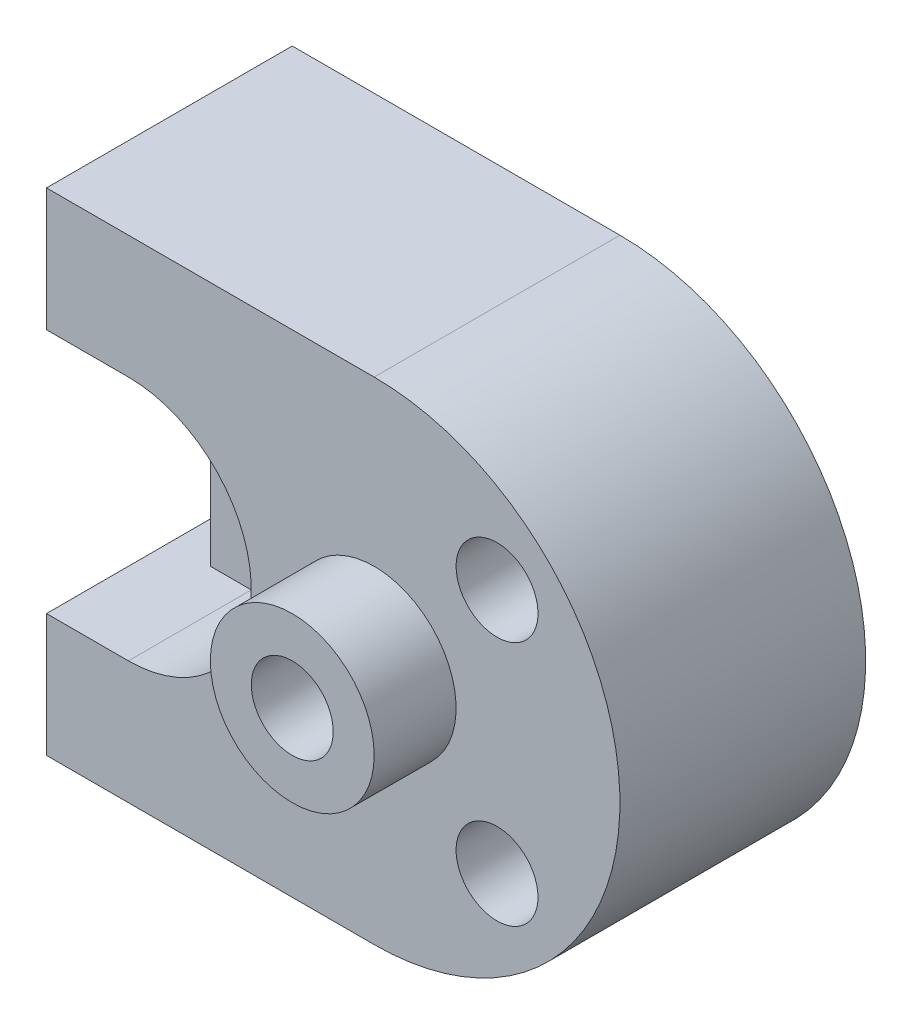
ISO-10303-21;
HEADER;
FILE_DESCRIPTION(('STEP AP214'),'2;1');
FILE_NAME('part.step','',(''),(''),'','','');
FILE_SCHEMA(('AUTOMOTIVE_DESIGN { 1 0 10303 214 1 1 1 1 }'));
ENDSEC;
DATA;
#1=APPLICATION_CONTEXT('core data for automotive mechanical design processes');
#2=APPLICATION_PROTOCOL_DEFINITION('international standard','automotive_design',2000,#1);
#3=PRODUCT_CONTEXT('',#1,'mechanical');
#4=PRODUCT('Part','Part','',(#3));
#5=PRODUCT_RELATED_PRODUCT_CATEGORY('part','',(#4));
#6=PRODUCT_DEFINITION_FORMATION('','',#4);
#7=PRODUCT_DEFINITION_CONTEXT('part definition',#1,'design');
#8=PRODUCT_DEFINITION('design','',#6,#7);
#9=PRODUCT_DEFINITION_SHAPE('','',#8);
#10=(LENGTH_UNIT() NAMED_UNIT(*) SI_UNIT(.MILLI.,.METRE.));
#11=(NAMED_UNIT(*) PLANE_ANGLE_UNIT() SI_UNIT($,.RADIAN.));
#12=(NAMED_UNIT(*) SI_UNIT($,.STERADIAN.) SOLID_ANGLE_UNIT());
#13=UNCERTAINTY_MEASURE_WITH_UNIT(LENGTH_MEASURE(1.E-05),#10,'distance_accuracy_value','');
#14=(GEOMETRIC_REPRESENTATION_CONTEXT(3) GLOBAL_UNCERTAINTY_ASSIGNED_CONTEXT((#13)) GLOBAL_UNIT_ASSIGNED_CONTEXT((#10,
#11,#12)) REPRESENTATION_CONTEXT('',''));
#15=CARTESIAN_POINT('',(0.,0.,0.));
#16=DIRECTION('',(0.,0.,1.));
#17=DIRECTION('',(1.,0.,0.));
#18=AXIS2_PLACEMENT_3D('',#15,#16,#17);
#19=CARTESIAN_POINT('',(0.,0.,60.));
#20=DIRECTION('',(0.,0.,-1.));
#21=DIRECTION('',(-1.,0.,0.));
#22=AXIS2_PLACEMENT_3D('',#19,#20,#21);
#23=PLANE('',#22);
#24=CARTESIAN_POINT('',(110.,90.,60.));
#25=DIRECTION('',(0.,0.,-1.));
#26=DIRECTION('',(-1.,0.,0.));
#27=AXIS2_PLACEMENT_3D('',#24,#25,#26);
#28=CIRCLE('',#27,9.99999999999999);
#29=CARTESIAN_POINT('',(100.,90.,60.));
#30=VERTEX_POINT('',#29);
#31=EDGE_CURVE('E153',#30,#30,#28,.F.);
#32=ORIENTED_EDGE('',*,*,#31,.F.);
#33=EDGE_LOOP('',(#32));
#34=FACE_BOUND('',#33,.T.);
#35=DIRECTION('',(1.,0.,0.));
#36=VECTOR('',#35,1.);
#37=CARTESIAN_POINT('',(0.,90.,60.));
#38=LINE('',#37,#36);
#39=CARTESIAN_POINT('',(0.,90.,60.));
#40=VERTEX_POINT('',#39);
#41=CARTESIAN_POINT('',(20.,90.,60.));
#42=VERTEX_POINT('',#41);
#43=EDGE_CURVE('E189',#40,#42,#38,.T.);
#44=ORIENTED_EDGE('',*,*,#43,.T.);
#45=CARTESIAN_POINT('',(20.,60.,60.));
#46=DIRECTION('',(0.,0.,-1.));
#47=DIRECTION('',(-1.,0.,0.));
#48=AXIS2_PLACEMENT_3D('',#45,#46,#47);
#49=CIRCLE('',#48,30.);
#50=CARTESIAN_POINT('',(20.,30.,60.));
#51=VERTEX_POINT('',#50);
#52=EDGE_CURVE('E41',#42,#51,#49,.T.);
#53=ORIENTED_EDGE('',*,*,#52,.T.);
#54=DIRECTION('',(1.,0.,0.));
#55=VECTOR('',#54,1.);
#56=CARTESIAN_POINT('',(0.,30.,60.));
#57=LINE('',#56,#55);
#58=CARTESIAN_POINT('',(0.,30.,60.));
#59=VERTEX_POINT('',#58);
#60=EDGE_CURVE('E187',#59,#51,#57,.T.);
#61=ORIENTED_EDGE('',*,*,#60,.F.);
#62=DIRECTION('',(0.,-1.,0.));
#63=VECTOR('',#62,1.);
#64=CARTESIAN_POINT('',(0.,0.,60.));
#65=LINE('',#64,#63);
#66=CARTESIAN_POINT('',(0.,0.,60.));
#67=VERTEX_POINT('',#66);
#68=EDGE_CURVE('E213',#59,#67,#65,.T.);
#69=ORIENTED_EDGE('',*,*,#68,.T.);
#70=DIRECTION('',(1.,0.,0.));
#71=VECTOR('',#70,1.);
#72=CARTESIAN_POINT('',(0.,0.,60.));
#73=LINE('',#72,#71);
#74=CARTESIAN_POINT('',(80.,0.,60.));
#75=VERTEX_POINT('',#74);
#76=EDGE_CURVE('E212',#67,#75,#73,.T.);
#77=ORIENTED_EDGE('',*,*,#76,.T.);
#78=CARTESIAN_POINT('',(80.,60.,60.));
#79=DIRECTION('',(0.,0.,1.));
#80=DIRECTION('',(1.,0.,0.));
#81=AXIS2_PLACEMENT_3D('',#78,#79,#80);
#82=CIRCLE('',#81,60.);
#83=CARTESIAN_POINT('',(80.,120.,60.));
#84=VERTEX_POINT('',#83);
#85=EDGE_CURVE('E200',#84,#75,#82,.F.);
#86=ORIENTED_EDGE('',*,*,#85,.F.);
#87=DIRECTION('',(-1.,0.,0.));
#88=VECTOR('',#87,1.);
#89=CARTESIAN_POINT('',(0.,120.,60.));
#90=LINE('',#89,#88);
#91=CARTESIAN_POINT('',(0.,120.,60.));
#92=VERTEX_POINT('',#91);
#93=EDGE_CURVE('E216',#84,#92,#90,.T.);
#94=ORIENTED_EDGE('',*,*,#93,.T.);
#95=EDGE_CURVE('E209',#92,#40,#65,.T.);
#96=ORIENTED_EDGE('',*,*,#95,.T.);
#97=EDGE_LOOP('',(#44,#53,#61,#69,#77,#86,#94,#96));
#98=FACE_BOUND('',#97,.T.);
#99=CARTESIAN_POINT('',(110.,30.,60.));
#100=DIRECTION('',(0.,0.,1.));
#101=DIRECTION('',(1.,0.,0.));
#102=AXIS2_PLACEMENT_3D('',#99,#100,#101);
#103=CIRCLE('',#102,9.99999999999999);
#104=CARTESIAN_POINT('',(120.,30.,60.));
#105=VERTEX_POINT('',#104);
#106=EDGE_CURVE('E138',#105,#105,#103,.T.);
#107=ORIENTED_EDGE('',*,*,#106,.F.);
#108=EDGE_LOOP('',(#107));
#109=FACE_BOUND('',#108,.T.);
#110=CARTESIAN_POINT('',(80.,60.,60.));
#111=DIRECTION('',(0.,0.,-1.));
#112=DIRECTION('',(-1.,0.,0.));
#113=AXIS2_PLACEMENT_3D('',#110,#111,#112);
#114=CIRCLE('',#113,20.);
#115=CARTESIAN_POINT('',(60.,60.,60.));
#116=VERTEX_POINT('',#115);
#117=EDGE_CURVE('E11',#116,#116,#114,.F.);
#118=ORIENTED_EDGE('',*,*,#117,.F.);
#119=EDGE_LOOP('',(#118));
#120=FACE_BOUND('',#119,.T.);
#121=ADVANCED_FACE('F33',(#34,#98,#109,#120),#23,.F.);
#122=CARTESIAN_POINT('',(110.,30.,-7.00000000000002));
#123=DIRECTION('',(0.,0.,1.));
#124=DIRECTION('',(1.,0.,0.));
#125=AXIS2_PLACEMENT_3D('',#122,#123,#124);
#126=CYLINDRICAL_SURFACE('',#125,5.00000000000001);
#127=CARTESIAN_POINT('',(110.,30.,40.));
#128=DIRECTION('',(0.,0.,1.));
#129=DIRECTION('',(1.,0.,0.));
#130=AXIS2_PLACEMENT_3D('',#127,#128,#129);
#131=CIRCLE('',#130,5.00000000000001);
#132=CARTESIAN_POINT('',(115.,30.,40.));
#133=VERTEX_POINT('',#132);
#134=EDGE_CURVE('E135',#133,#133,#131,.T.);
#135=ORIENTED_EDGE('',*,*,#134,.T.);
#136=EDGE_LOOP('',(#135));
#137=FACE_BOUND('',#136,.T.);
#138=CARTESIAN_POINT('',(110.,30.,20.));
#139=DIRECTION('',(0.,0.,-1.));
#140=DIRECTION('',(-1.,0.,0.));
#141=AXIS2_PLACEMENT_3D('',#138,#139,#140);
#142=CIRCLE('',#141,5.00000000000001);
#143=CARTESIAN_POINT('',(105.,30.,20.));
#144=VERTEX_POINT('',#143);
#145=EDGE_CURVE('E132',#144,#144,#142,.F.);
#146=ORIENTED_EDGE('',*,*,#145,.F.);
#147=EDGE_LOOP('',(#146));
#148=FACE_BOUND('',#147,.T.);
#149=ADVANCED_FACE('F242',(#137,#148),#126,.F.);
#150=CARTESIAN_POINT('',(10.,90.,0.));
#151=DIRECTION('',(-1.,0.,0.));
#152=DIRECTION('',(0.,-1.,0.));
#153=AXIS2_PLACEMENT_3D('',#150,#151,#152);
#154=PLANE('',#153);
#155=DIRECTION('',(0.,0.,1.));
#156=VECTOR('',#155,1.);
#157=CARTESIAN_POINT('',(10.,30.,0.));
#158=LINE('',#157,#156);
#159=CARTESIAN_POINT('',(10.,30.,0.));
#160=VERTEX_POINT('',#159);
#161=CARTESIAN_POINT('',(10.,30.,30.));
#162=VERTEX_POINT('',#161);
#163=EDGE_CURVE('E53',#160,#162,#158,.T.);
#164=ORIENTED_EDGE('',*,*,#163,.T.);
#165=DIRECTION('',(0.,-1.,0.));
#166=VECTOR('',#165,1.);
#167=CARTESIAN_POINT('',(10.,0.,30.));
#168=LINE('',#167,#166);
#169=CARTESIAN_POINT('',(10.,90.,30.));
#170=VERTEX_POINT('',#169);
#171=EDGE_CURVE('E170',#170,#162,#168,.T.);
#172=ORIENTED_EDGE('',*,*,#171,.F.);
#173=DIRECTION('',(0.,0.,1.));
#174=VECTOR('',#173,1.);
#175=CARTESIAN_POINT('',(10.,90.,0.));
#176=LINE('',#175,#174);
#177=CARTESIAN_POINT('',(10.,90.,0.));
#178=VERTEX_POINT('',#177);
#179=EDGE_CURVE('E177',#178,#170,#176,.T.);
#180=ORIENTED_EDGE('',*,*,#179,.F.);
#181=DIRECTION('',(0.,-1.,0.));
#182=VECTOR('',#181,1.);
#183=CARTESIAN_POINT('',(10.,90.,0.));
#184=LINE('',#183,#182);
#185=EDGE_CURVE('E195',#178,#160,#184,.T.);
#186=ORIENTED_EDGE('',*,*,#185,.T.);
#187=EDGE_LOOP('',(#164,#172,#180,#186));
#188=FACE_BOUND('',#187,.T.);
#189=ADVANCED_FACE('F244',(#188),#154,.T.);
#190=CARTESIAN_POINT('',(0.,0.,60.));
#191=DIRECTION('',(1.,0.,0.));
#192=DIRECTION('',(0.,0.,-1.));
#193=AXIS2_PLACEMENT_3D('',#190,#191,#192);
#194=PLANE('',#193);
#195=DIRECTION('',(0.,0.,1.));
#196=VECTOR('',#195,1.);
#197=CARTESIAN_POINT('',(0.,90.,0.));
#198=LINE('',#197,#196);
#199=CARTESIAN_POINT('',(0.,90.,0.));
#200=VERTEX_POINT('',#199);
#201=EDGE_CURVE('E183',#200,#40,#198,.T.);
#202=ORIENTED_EDGE('',*,*,#201,.T.);
#203=ORIENTED_EDGE('',*,*,#95,.F.);
#204=DIRECTION('',(0.,0.,-1.));
#205=VECTOR('',#204,1.);
#206=CARTESIAN_POINT('',(0.,120.,60.));
#207=LINE('',#206,#205);
#208=CARTESIAN_POINT('',(0.,120.,0.));
#209=VERTEX_POINT('',#208);
#210=EDGE_CURVE('E218',#92,#209,#207,.T.);
#211=ORIENTED_EDGE('',*,*,#210,.T.);
#212=DIRECTION('',(0.,-1.,0.));
#213=VECTOR('',#212,1.);
#214=CARTESIAN_POINT('',(0.,0.,0.));
#215=LINE('',#214,#213);
#216=EDGE_CURVE('E219',#209,#200,#215,.T.);
#217=ORIENTED_EDGE('',*,*,#216,.T.);
#218=EDGE_LOOP('',(#202,#203,#211,#217));
#219=FACE_BOUND('',#218,.T.);
#220=ADVANCED_FACE('F251',(#219),#194,.F.);
#221=CARTESIAN_POINT('',(0.,0.,0.));
#222=DIRECTION('',(0.,0.,-1.));
#223=DIRECTION('',(-1.,0.,0.));
#224=AXIS2_PLACEMENT_3D('',#221,#222,#223);
#225=PLANE('',#224);
#226=CARTESIAN_POINT('',(110.,30.,0.));
#227=DIRECTION('',(0.,0.,-1.));
#228=DIRECTION('',(-1.,0.,0.));
#229=AXIS2_PLACEMENT_3D('',#226,#227,#228);
#230=CIRCLE('',#229,9.99999999999999);
#231=CARTESIAN_POINT('',(100.,30.,0.));
#232=VERTEX_POINT('',#231);
#233=EDGE_CURVE('E124',#232,#232,#230,.T.);
#234=ORIENTED_EDGE('',*,*,#233,.F.);
#235=EDGE_LOOP('',(#234));
#236=FACE_BOUND('',#235,.T.);
#237=CARTESIAN_POINT('',(110.,90.,0.));
#238=DIRECTION('',(0.,0.,-1.));
#239=DIRECTION('',(-1.,0.,0.));
#240=AXIS2_PLACEMENT_3D('',#237,#238,#239);
#241=CIRCLE('',#240,9.99999999999999);
#242=CARTESIAN_POINT('',(100.,90.,0.));
#243=VERTEX_POINT('',#242);
#244=EDGE_CURVE('E157',#243,#243,#241,.T.);
#245=ORIENTED_EDGE('',*,*,#244,.F.);
#246=EDGE_LOOP('',(#245));
#247=FACE_BOUND('',#246,.T.);
#248=CARTESIAN_POINT('',(30.,60.,0.));
#249=DIRECTION('',(0.,0.,-1.));
#250=DIRECTION('',(-1.,0.,0.));
#251=AXIS2_PLACEMENT_3D('',#248,#249,#250);
#252=CIRCLE('',#251,10.);
#253=CARTESIAN_POINT('',(20.,60.,0.));
#254=VERTEX_POINT('',#253);
#255=EDGE_CURVE('E161',#254,#254,#252,.T.);
#256=ORIENTED_EDGE('',*,*,#255,.F.);
#257=EDGE_LOOP('',(#256));
#258=FACE_BOUND('',#257,.T.);
#259=ORIENTED_EDGE('',*,*,#185,.F.);
#260=DIRECTION('',(1.,0.,0.));
#261=VECTOR('',#260,1.);
#262=CARTESIAN_POINT('',(0.,90.,0.));
#263=LINE('',#262,#261);
#264=EDGE_CURVE('E190',#200,#178,#263,.T.);
#265=ORIENTED_EDGE('',*,*,#264,.F.);
#266=ORIENTED_EDGE('',*,*,#216,.F.);
#267=DIRECTION('',(-1.,0.,0.));
#268=VECTOR('',#267,1.);
#269=CARTESIAN_POINT('',(0.,120.,0.));
#270=LINE('',#269,#268);
#271=CARTESIAN_POINT('',(80.,120.,0.));
#272=VERTEX_POINT('',#271);
#273=EDGE_CURVE('E225',#272,#209,#270,.T.);
#274=ORIENTED_EDGE('',*,*,#273,.F.);
#275=CARTESIAN_POINT('',(80.,60.,0.));
#276=DIRECTION('',(0.,0.,1.));
#277=DIRECTION('',(1.,0.,0.));
#278=AXIS2_PLACEMENT_3D('',#275,#276,#277);
#279=CIRCLE('',#278,60.);
#280=CARTESIAN_POINT('',(80.,0.,0.));
#281=VERTEX_POINT('',#280);
#282=EDGE_CURVE('E201',#272,#281,#279,.F.);
#283=ORIENTED_EDGE('',*,*,#282,.T.);
#284=DIRECTION('',(1.,0.,0.));
#285=VECTOR('',#284,1.);
#286=CARTESIAN_POINT('',(0.,0.,0.));
#287=LINE('',#286,#285);
#288=CARTESIAN_POINT('',(0.,0.,0.));
#289=VERTEX_POINT('',#288);
#290=EDGE_CURVE('E222',#289,#281,#287,.T.);
#291=ORIENTED_EDGE('',*,*,#290,.F.);
#292=CARTESIAN_POINT('',(0.,30.,0.));
#293=VERTEX_POINT('',#292);
#294=EDGE_CURVE('E208',#293,#289,#215,.T.);
#295=ORIENTED_EDGE('',*,*,#294,.F.);
#296=DIRECTION('',(1.,0.,0.));
#297=VECTOR('',#296,1.);
#298=CARTESIAN_POINT('',(0.,30.,0.));
#299=LINE('',#298,#297);
#300=EDGE_CURVE('E186',#293,#160,#299,.T.);
#301=ORIENTED_EDGE('',*,*,#300,.T.);
#302=EDGE_LOOP('',(#259,#265,#266,#274,#283,#291,#295,#301));
#303=FACE_BOUND('',#302,.T.);
#304=ADVANCED_FACE('F312',(#236,#247,#258,#303),#225,.T.);
#305=CARTESIAN_POINT('',(0.,0.,60.));
#306=DIRECTION('',(0.,1.,0.));
#307=DIRECTION('',(0.,0.,1.));
#308=AXIS2_PLACEMENT_3D('',#305,#306,#307);
#309=PLANE('',#308);
#310=DIRECTION('',(0.,0.,1.));
#311=VECTOR('',#310,1.);
#312=CARTESIAN_POINT('',(80.,0.,0.));
#313=LINE('',#312,#311);
#314=EDGE_CURVE('E204',#281,#75,#313,.T.);
#315=ORIENTED_EDGE('',*,*,#314,.T.);
#316=ORIENTED_EDGE('',*,*,#76,.F.);
#317=DIRECTION('',(0.,0.,-1.));
#318=VECTOR('',#317,1.);
#319=CARTESIAN_POINT('',(0.,0.,60.));
#320=LINE('',#319,#318);
#321=EDGE_CURVE('E229',#67,#289,#320,.T.);
#322=ORIENTED_EDGE('',*,*,#321,.T.);
#323=ORIENTED_EDGE('',*,*,#290,.T.);
#324=EDGE_LOOP('',(#315,#316,#322,#323));
#325=FACE_BOUND('',#324,.T.);
#326=ADVANCED_FACE('F315',(#325),#309,.F.);
#327=ORIENTED_EDGE('',*,*,#68,.F.);
#328=DIRECTION('',(0.,0.,1.));
#329=VECTOR('',#328,1.);
#330=CARTESIAN_POINT('',(0.,30.,0.));
#331=LINE('',#330,#329);
#332=EDGE_CURVE('E181',#293,#59,#331,.T.);
#333=ORIENTED_EDGE('',*,*,#332,.F.);
#334=ORIENTED_EDGE('',*,*,#294,.T.);
#335=ORIENTED_EDGE('',*,*,#321,.F.);
#336=EDGE_LOOP('',(#327,#333,#334,#335));
#337=FACE_BOUND('',#336,.T.);
#338=ADVANCED_FACE('F35',(#337),#194,.F.);
#339=CARTESIAN_POINT('',(0.,120.,60.));
#340=DIRECTION('',(0.,-1.,0.));
#341=DIRECTION('',(0.,0.,-1.));
#342=AXIS2_PLACEMENT_3D('',#339,#340,#341);
#343=PLANE('',#342);
#344=ORIENTED_EDGE('',*,*,#93,.F.);
#345=DIRECTION('',(0.,0.,1.));
#346=VECTOR('',#345,1.);
#347=CARTESIAN_POINT('',(80.,120.,0.));
#348=LINE('',#347,#346);
#349=EDGE_CURVE('E192',#272,#84,#348,.T.);
#350=ORIENTED_EDGE('',*,*,#349,.F.);
#351=ORIENTED_EDGE('',*,*,#273,.T.);
#352=ORIENTED_EDGE('',*,*,#210,.F.);
#353=EDGE_LOOP('',(#344,#350,#351,#352));
#354=FACE_BOUND('',#353,.T.);
#355=ADVANCED_FACE('F309',(#354),#343,.F.);
#356=CARTESIAN_POINT('',(80.,60.,0.));
#357=DIRECTION('',(0.,0.,1.));
#358=DIRECTION('',(1.,0.,0.));
#359=AXIS2_PLACEMENT_3D('',#356,#357,#358);
#360=CYLINDRICAL_SURFACE('',#359,60.);
#361=ORIENTED_EDGE('',*,*,#85,.T.);
#362=ORIENTED_EDGE('',*,*,#314,.F.);
#363=ORIENTED_EDGE('',*,*,#282,.F.);
#364=ORIENTED_EDGE('',*,*,#349,.T.);
#365=EDGE_LOOP('',(#361,#362,#363,#364));
#366=FACE_BOUND('',#365,.T.);
#367=ADVANCED_FACE('F303',(#366),#360,.T.);
#368=CARTESIAN_POINT('',(0.,90.,0.));
#369=DIRECTION('',(0.,-1.,0.));
#370=DIRECTION('',(0.,0.,-1.));
#371=AXIS2_PLACEMENT_3D('',#368,#369,#370);
#372=PLANE('',#371);
#373=ORIENTED_EDGE('',*,*,#43,.F.);
#374=ORIENTED_EDGE('',*,*,#201,.F.);
#375=ORIENTED_EDGE('',*,*,#264,.T.);
#376=ORIENTED_EDGE('',*,*,#179,.T.);
#377=DIRECTION('',(1.,0.,0.));
#378=VECTOR('',#377,1.);
#379=CARTESIAN_POINT('',(1.2490009027033E-13,90.,30.));
#380=LINE('',#379,#378);
#381=CARTESIAN_POINT('',(20.,90.,30.));
#382=VERTEX_POINT('',#381);
#383=EDGE_CURVE('E167',#170,#382,#380,.T.);
#384=ORIENTED_EDGE('',*,*,#383,.T.);
#385=DIRECTION('',(0.,0.,-1.));
#386=VECTOR('',#385,1.);
#387=CARTESIAN_POINT('',(20.,90.,90.));
#388=LINE('',#387,#386);
#389=EDGE_CURVE('E175',#42,#382,#388,.T.);
#390=ORIENTED_EDGE('',*,*,#389,.F.);
#391=EDGE_LOOP('',(#373,#374,#375,#376,#384,#390));
#392=FACE_BOUND('',#391,.T.);
#393=ADVANCED_FACE('F301',(#392),#372,.T.);
#394=CARTESIAN_POINT('',(0.,30.,0.));
#395=DIRECTION('',(0.,-1.,0.));
#396=DIRECTION('',(0.,0.,-1.));
#397=AXIS2_PLACEMENT_3D('',#394,#395,#396);
#398=PLANE('',#397);
#399=ORIENTED_EDGE('',*,*,#60,.T.);
#400=DIRECTION('',(0.,0.,-1.));
#401=VECTOR('',#400,1.);
#402=CARTESIAN_POINT('',(20.,30.,90.));
#403=LINE('',#402,#401);
#404=CARTESIAN_POINT('',(20.,30.,30.));
#405=VERTEX_POINT('',#404);
#406=EDGE_CURVE('E173',#51,#405,#403,.T.);
#407=ORIENTED_EDGE('',*,*,#406,.T.);
#408=DIRECTION('',(1.,0.,0.));
#409=VECTOR('',#408,1.);
#410=CARTESIAN_POINT('',(0.,30.,30.));
#411=LINE('',#410,#409);
#412=EDGE_CURVE('E48',#162,#405,#411,.T.);
#413=ORIENTED_EDGE('',*,*,#412,.F.);
#414=ORIENTED_EDGE('',*,*,#163,.F.);
#415=ORIENTED_EDGE('',*,*,#300,.F.);
#416=ORIENTED_EDGE('',*,*,#332,.T.);
#417=EDGE_LOOP('',(#399,#407,#413,#414,#415,#416));
#418=FACE_BOUND('',#417,.T.);
#419=ADVANCED_FACE('F299',(#418),#398,.F.);
#420=CARTESIAN_POINT('',(20.,60.,90.));
#421=DIRECTION('',(0.,0.,-1.));
#422=DIRECTION('',(-1.,0.,0.));
#423=AXIS2_PLACEMENT_3D('',#420,#421,#422);
#424=CYLINDRICAL_SURFACE('',#423,30.);
#425=ORIENTED_EDGE('',*,*,#389,.T.);
#426=CARTESIAN_POINT('',(20.,60.,30.));
#427=DIRECTION('',(0.,0.,1.));
#428=DIRECTION('',(1.,0.,0.));
#429=AXIS2_PLACEMENT_3D('',#426,#427,#428);
#430=CIRCLE('',#429,30.);
#431=EDGE_CURVE('E164',#382,#405,#430,.F.);
#432=ORIENTED_EDGE('',*,*,#431,.T.);
#433=ORIENTED_EDGE('',*,*,#406,.F.);
#434=ORIENTED_EDGE('',*,*,#52,.F.);
#435=EDGE_LOOP('',(#425,#432,#433,#434));
#436=FACE_BOUND('',#435,.T.);
#437=ADVANCED_FACE('F295',(#436),#424,.F.);
#438=CARTESIAN_POINT('',(0.,0.,30.));
#439=DIRECTION('',(0.,0.,1.));
#440=DIRECTION('',(1.,0.,0.));
#441=AXIS2_PLACEMENT_3D('',#438,#439,#440);
#442=PLANE('',#441);
#443=CARTESIAN_POINT('',(30.,60.,30.));
#444=DIRECTION('',(0.,0.,1.));
#445=DIRECTION('',(1.,0.,0.));
#446=AXIS2_PLACEMENT_3D('',#443,#444,#445);
#447=CIRCLE('',#446,10.);
#448=CARTESIAN_POINT('',(40.,60.,30.));
#449=VERTEX_POINT('',#448);
#450=EDGE_CURVE('E158',#449,#449,#447,.T.);
#451=ORIENTED_EDGE('',*,*,#450,.F.);
#452=EDGE_LOOP('',(#451));
#453=FACE_BOUND('',#452,.T.);
#454=ORIENTED_EDGE('',*,*,#431,.F.);
#455=ORIENTED_EDGE('',*,*,#383,.F.);
#456=ORIENTED_EDGE('',*,*,#171,.T.);
#457=ORIENTED_EDGE('',*,*,#412,.T.);
#458=EDGE_LOOP('',(#454,#455,#456,#457));
#459=FACE_BOUND('',#458,.T.);
#460=ADVANCED_FACE('F291',(#453,#459),#442,.T.);
#461=CARTESIAN_POINT('',(30.,60.,-30.));
#462=DIRECTION('',(0.,0.,1.));
#463=DIRECTION('',(1.,0.,0.));
#464=AXIS2_PLACEMENT_3D('',#461,#462,#463);
#465=CYLINDRICAL_SURFACE('',#464,10.);
#466=ORIENTED_EDGE('',*,*,#255,.T.);
#467=EDGE_LOOP('',(#466));
#468=FACE_BOUND('',#467,.T.);
#469=ORIENTED_EDGE('',*,*,#450,.T.);
#470=EDGE_LOOP('',(#469));
#471=FACE_BOUND('',#470,.T.);
#472=ADVANCED_FACE('F287',(#468,#471),#465,.F.);
#473=CARTESIAN_POINT('',(110.,90.,-40.));
#474=DIRECTION('',(0.,0.,1.));
#475=DIRECTION('',(1.,0.,0.));
#476=AXIS2_PLACEMENT_3D('',#473,#474,#475);
#477=CYLINDRICAL_SURFACE('',#476,9.99999999999999);
#478=ORIENTED_EDGE('',*,*,#244,.T.);
#479=EDGE_LOOP('',(#478));
#480=FACE_BOUND('',#479,.T.);
#481=CARTESIAN_POINT('',(110.,90.,20.));
#482=DIRECTION('',(0.,0.,1.));
#483=DIRECTION('',(1.,0.,0.));
#484=AXIS2_PLACEMENT_3D('',#481,#482,#483);
#485=CIRCLE('',#484,9.99999999999999);
#486=CARTESIAN_POINT('',(120.,90.,20.));
#487=VERTEX_POINT('',#486);
#488=EDGE_CURVE('E154',#487,#487,#485,.T.);
#489=ORIENTED_EDGE('',*,*,#488,.T.);
#490=EDGE_LOOP('',(#489));
#491=FACE_BOUND('',#490,.T.);
#492=ADVANCED_FACE('F283',(#480,#491),#477,.F.);
#493=CARTESIAN_POINT('',(110.,90.,20.));
#494=DIRECTION('',(0.,0.,1.));
#495=DIRECTION('',(1.,0.,0.));
#496=AXIS2_PLACEMENT_3D('',#493,#494,#495);
#497=PLANE('',#496);
#498=CARTESIAN_POINT('',(110.,90.,20.));
#499=DIRECTION('',(0.,0.,1.));
#500=DIRECTION('',(1.,0.,0.));
#501=AXIS2_PLACEMENT_3D('',#498,#499,#500);
#502=CIRCLE('',#501,5.00000000000001);
#503=CARTESIAN_POINT('',(115.,90.,20.));
#504=VERTEX_POINT('',#503);
#505=EDGE_CURVE('E147',#504,#504,#502,.T.);
#506=ORIENTED_EDGE('',*,*,#505,.T.);
#507=EDGE_LOOP('',(#506));
#508=FACE_BOUND('',#507,.T.);
#509=ORIENTED_EDGE('',*,*,#488,.F.);
#510=EDGE_LOOP('',(#509));
#511=FACE_BOUND('',#510,.T.);
#512=ADVANCED_FACE('F279',(#508,#511),#497,.F.);
#513=CARTESIAN_POINT('',(110.,90.,100.));
#514=DIRECTION('',(0.,0.,-1.));
#515=DIRECTION('',(-1.,0.,0.));
#516=AXIS2_PLACEMENT_3D('',#513,#514,#515);
#517=CYLINDRICAL_SURFACE('',#516,9.99999999999999);
#518=CARTESIAN_POINT('',(110.,90.,40.));
#519=DIRECTION('',(0.,0.,1.));
#520=DIRECTION('',(1.,0.,0.));
#521=AXIS2_PLACEMENT_3D('',#518,#519,#520);
#522=CIRCLE('',#521,9.99999999999999);
#523=CARTESIAN_POINT('',(120.,90.,40.));
#524=VERTEX_POINT('',#523);
#525=EDGE_CURVE('E150',#524,#524,#522,.T.);
#526=ORIENTED_EDGE('',*,*,#525,.F.);
#527=EDGE_LOOP('',(#526));
#528=FACE_BOUND('',#527,.T.);
#529=ORIENTED_EDGE('',*,*,#31,.T.);
#530=EDGE_LOOP('',(#529));
#531=FACE_BOUND('',#530,.T.);
#532=ADVANCED_FACE('F275',(#528,#531),#517,.F.);
#533=CARTESIAN_POINT('',(110.,90.,40.));
#534=DIRECTION('',(0.,0.,1.));
#535=DIRECTION('',(1.,0.,0.));
#536=AXIS2_PLACEMENT_3D('',#533,#534,#535);
#537=PLANE('',#536);
#538=CARTESIAN_POINT('',(110.,90.,40.));
#539=DIRECTION('',(0.,0.,1.));
#540=DIRECTION('',(1.,0.,0.));
#541=AXIS2_PLACEMENT_3D('',#538,#539,#540);
#542=CIRCLE('',#541,5.00000000000001);
#543=CARTESIAN_POINT('',(115.,90.,40.));
#544=VERTEX_POINT('',#543);
#545=EDGE_CURVE('E142',#544,#544,#542,.T.);
#546=ORIENTED_EDGE('',*,*,#545,.F.);
#547=EDGE_LOOP('',(#546));
#548=FACE_BOUND('',#547,.T.);
#549=ORIENTED_EDGE('',*,*,#525,.T.);
#550=EDGE_LOOP('',(#549));
#551=FACE_BOUND('',#550,.T.);
#552=ADVANCED_FACE('F271',(#548,#551),#537,.T.);
#553=CARTESIAN_POINT('',(110.,90.,-20.));
#554=DIRECTION('',(0.,0.,1.));
#555=DIRECTION('',(1.,0.,0.));
#556=AXIS2_PLACEMENT_3D('',#553,#554,#555);
#557=CYLINDRICAL_SURFACE('',#556,5.00000000000001);
#558=ORIENTED_EDGE('',*,*,#545,.T.);
#559=EDGE_LOOP('',(#558));
#560=FACE_BOUND('',#559,.T.);
#561=ORIENTED_EDGE('',*,*,#505,.F.);
#562=EDGE_LOOP('',(#561));
#563=FACE_BOUND('',#562,.T.);
#564=ADVANCED_FACE('F267',(#560,#563),#557,.F.);
#565=CARTESIAN_POINT('',(110.,30.,40.));
#566=DIRECTION('',(0.,0.,1.));
#567=DIRECTION('',(1.,0.,0.));
#568=AXIS2_PLACEMENT_3D('',#565,#566,#567);
#569=CYLINDRICAL_SURFACE('',#568,9.99999999999999);
#570=CARTESIAN_POINT('',(110.,30.,40.));
#571=DIRECTION('',(0.,0.,1.));
#572=DIRECTION('',(1.,0.,0.));
#573=AXIS2_PLACEMENT_3D('',#570,#571,#572);
#574=CIRCLE('',#573,9.99999999999999);
#575=CARTESIAN_POINT('',(120.,30.,40.));
#576=VERTEX_POINT('',#575);
#577=EDGE_CURVE('E139',#576,#576,#574,.T.);
#578=ORIENTED_EDGE('',*,*,#577,.F.);
#579=EDGE_LOOP('',(#578));
#580=FACE_BOUND('',#579,.T.);
#581=ORIENTED_EDGE('',*,*,#106,.T.);
#582=EDGE_LOOP('',(#581));
#583=FACE_BOUND('',#582,.T.);
#584=ADVANCED_FACE('F263',(#580,#583),#569,.F.);
#585=CARTESIAN_POINT('',(110.,30.,40.));
#586=DIRECTION('',(0.,0.,1.));
#587=DIRECTION('',(1.,0.,0.));
#588=AXIS2_PLACEMENT_3D('',#585,#586,#587);
#589=PLANE('',#588);
#590=ORIENTED_EDGE('',*,*,#134,.F.);
#591=EDGE_LOOP('',(#590));
#592=FACE_BOUND('',#591,.T.);
#593=ORIENTED_EDGE('',*,*,#577,.T.);
#594=EDGE_LOOP('',(#593));
#595=FACE_BOUND('',#594,.T.);
#596=ADVANCED_FACE('F260',(#592,#595),#589,.T.);
#597=CARTESIAN_POINT('',(110.,30.,20.));
#598=DIRECTION('',(0.,0.,-1.));
#599=DIRECTION('',(-1.,0.,0.));
#600=AXIS2_PLACEMENT_3D('',#597,#598,#599);
#601=PLANE('',#600);
#602=CARTESIAN_POINT('',(110.,30.,20.));
#603=DIRECTION('',(0.,0.,-1.));
#604=DIRECTION('',(-1.,0.,0.));
#605=AXIS2_PLACEMENT_3D('',#602,#603,#604);
#606=CIRCLE('',#605,9.99999999999999);
#607=CARTESIAN_POINT('',(100.,30.,20.));
#608=VERTEX_POINT('',#607);
#609=EDGE_CURVE('E129',#608,#608,#606,.T.);
#610=ORIENTED_EDGE('',*,*,#609,.T.);
#611=EDGE_LOOP('',(#610));
#612=FACE_BOUND('',#611,.T.);
#613=ORIENTED_EDGE('',*,*,#145,.T.);
#614=EDGE_LOOP('',(#613));
#615=FACE_BOUND('',#614,.T.);
#616=ADVANCED_FACE('F240',(#612,#615),#601,.T.);
#617=CARTESIAN_POINT('',(110.,30.,20.));
#618=DIRECTION('',(0.,0.,-1.));
#619=DIRECTION('',(-1.,0.,0.));
#620=AXIS2_PLACEMENT_3D('',#617,#618,#619);
#621=CYLINDRICAL_SURFACE('',#620,9.99999999999999);
#622=ORIENTED_EDGE('',*,*,#609,.F.);
#623=EDGE_LOOP('',(#622));
#624=FACE_BOUND('',#623,.T.);
#625=ORIENTED_EDGE('',*,*,#233,.T.);
#626=EDGE_LOOP('',(#625));
#627=FACE_BOUND('',#626,.T.);
#628=ADVANCED_FACE('F258',(#624,#627),#621,.F.);
#629=CARTESIAN_POINT('',(80.,60.,80.));
#630=DIRECTION('',(0.,0.,-1.));
#631=DIRECTION('',(-1.,0.,0.));
#632=AXIS2_PLACEMENT_3D('',#629,#630,#631);
#633=CYLINDRICAL_SURFACE('',#632,20.);
#634=CARTESIAN_POINT('',(80.,60.,80.));
#635=DIRECTION('',(0.,0.,1.));
#636=DIRECTION('',(1.,0.,0.));
#637=AXIS2_PLACEMENT_3D('',#634,#635,#636);
#638=CIRCLE('',#637,20.);
#639=CARTESIAN_POINT('',(100.,60.,80.));
#640=VERTEX_POINT('',#639);
#641=EDGE_CURVE('E120',#640,#640,#638,.T.);
#642=ORIENTED_EDGE('',*,*,#641,.F.);
#643=EDGE_LOOP('',(#642));
#644=FACE_BOUND('',#643,.T.);
#645=ORIENTED_EDGE('',*,*,#117,.T.);
#646=EDGE_LOOP('',(#645));
#647=FACE_BOUND('',#646,.T.);
#648=ADVANCED_FACE('F381',(#644,#647),#633,.T.);
#649=CARTESIAN_POINT('',(80.,60.,80.));
#650=DIRECTION('',(0.,0.,1.));
#651=DIRECTION('',(1.,0.,0.));
#652=AXIS2_PLACEMENT_3D('',#649,#650,#651);
#653=PLANE('',#652);
#654=CARTESIAN_POINT('',(80.,60.,80.));
#655=DIRECTION('',(0.,0.,1.));
#656=DIRECTION('',(1.,0.,0.));
#657=AXIS2_PLACEMENT_3D('',#654,#655,#656);
#658=CIRCLE('',#657,9.99999999999998);
#659=CARTESIAN_POINT('',(90.,60.,80.));
#660=VERTEX_POINT('',#659);
#661=EDGE_CURVE('E121',#660,#660,#658,.T.);
#662=ORIENTED_EDGE('',*,*,#661,.F.);
#663=EDGE_LOOP('',(#662));
#664=FACE_BOUND('',#663,.T.);
#665=ORIENTED_EDGE('',*,*,#641,.T.);
#666=EDGE_LOOP('',(#665));
#667=FACE_BOUND('',#666,.T.);
#668=ADVANCED_FACE('F114',(#664,#667),#653,.T.);
#669=CARTESIAN_POINT('',(80.,60.,50.));
#670=DIRECTION('',(0.,0.,1.));
#671=DIRECTION('',(1.,0.,0.));
#672=AXIS2_PLACEMENT_3D('',#669,#670,#671);
#673=CONICAL_SURFACE('',#672,9.99999999999998,1.02974425867665);
#674=CARTESIAN_POINT('',(80.,60.,43.9913938097244));
#675=VERTEX_POINT('',#674);
#676=VERTEX_LOOP('',#675);
#677=FACE_BOUND('',#676,.T.);
#678=CARTESIAN_POINT('',(80.,60.,50.));
#679=DIRECTION('',(0.,0.,1.));
#680=DIRECTION('',(1.,0.,0.));
#681=AXIS2_PLACEMENT_3D('',#678,#679,#680);
#682=CIRCLE('',#681,9.99999999999998);
#683=CARTESIAN_POINT('',(90.,60.,50.));
#684=VERTEX_POINT('',#683);
#685=EDGE_CURVE('E118',#684,#684,#682,.T.);
#686=ORIENTED_EDGE('',*,*,#685,.T.);
#687=EDGE_LOOP('',(#686));
#688=FACE_BOUND('',#687,.T.);
#689=ADVANCED_FACE('F110',(#677,#688),#673,.F.);
#690=CARTESIAN_POINT('',(80.,60.,80.));
#691=DIRECTION('',(0.,0.,1.));
#692=DIRECTION('',(1.,0.,0.));
#693=AXIS2_PLACEMENT_3D('',#690,#691,#692);
#694=CYLINDRICAL_SURFACE('',#693,9.99999999999998);
#695=ORIENTED_EDGE('',*,*,#685,.F.);
#696=EDGE_LOOP('',(#695));
#697=FACE_BOUND('',#696,.T.);
#698=ORIENTED_EDGE('',*,*,#661,.T.);
#699=EDGE_LOOP('',(#698));
#700=FACE_BOUND('',#699,.T.);
#701=ADVANCED_FACE('F113',(#697,#700),#694,.F.);
#702=CLOSED_SHELL('',(#121,#149,#189,#220,#304,#326,#338,#355,#367,#393,#419,#437,#460,#472,
#492,#512,#532,#552,#564,#584,#596,#616,#628,#648,#668,#689,#701));
#703=MANIFOLD_SOLID_BREP('B2',#702);
#704=ADVANCED_BREP_SHAPE_REPRESENTATION('',(#18,#703),#14);
#705=SHAPE_DEFINITION_REPRESENTATION(#9,#704);
ENDSEC;
END-ISO-10303-21;
